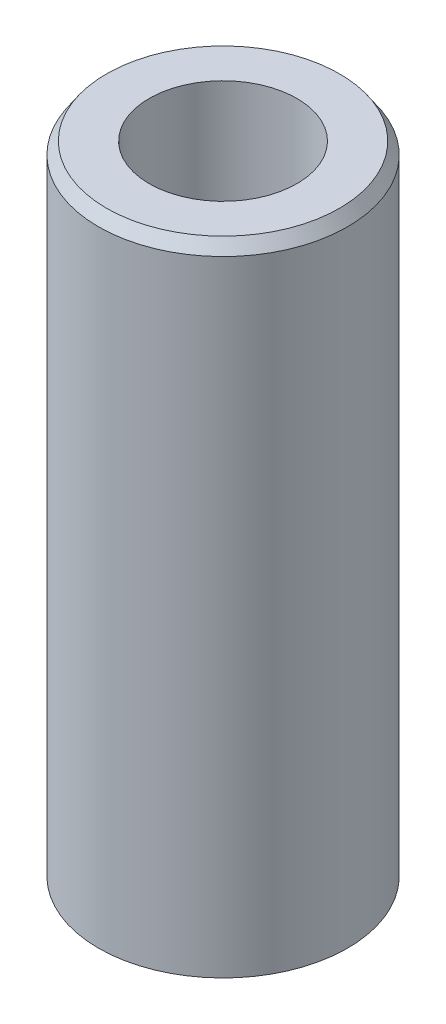
ISO-10303-21;
HEADER;
FILE_DESCRIPTION(('STEP AP214'),'2;1');
FILE_NAME('part.step','',(''),(''),'','','');
FILE_SCHEMA(('AUTOMOTIVE_DESIGN { 1 0 10303 214 1 1 1 1 }'));
ENDSEC;
DATA;
#1=APPLICATION_CONTEXT('core data for automotive mechanical design processes');
#2=APPLICATION_PROTOCOL_DEFINITION('international standard','automotive_design',2000,#1);
#3=PRODUCT_CONTEXT('',#1,'mechanical');
#4=PRODUCT('Part','Part','',(#3));
#5=PRODUCT_RELATED_PRODUCT_CATEGORY('part','',(#4));
#6=PRODUCT_DEFINITION_FORMATION('','',#4);
#7=PRODUCT_DEFINITION_CONTEXT('part definition',#1,'design');
#8=PRODUCT_DEFINITION('design','',#6,#7);
#9=PRODUCT_DEFINITION_SHAPE('','',#8);
#10=(LENGTH_UNIT() NAMED_UNIT(*) SI_UNIT(.MILLI.,.METRE.));
#11=(NAMED_UNIT(*) PLANE_ANGLE_UNIT() SI_UNIT($,.RADIAN.));
#12=(NAMED_UNIT(*) SI_UNIT($,.STERADIAN.) SOLID_ANGLE_UNIT());
#13=UNCERTAINTY_MEASURE_WITH_UNIT(LENGTH_MEASURE(1.E-05),#10,'distance_accuracy_value','');
#14=(GEOMETRIC_REPRESENTATION_CONTEXT(3) GLOBAL_UNCERTAINTY_ASSIGNED_CONTEXT((#13)) GLOBAL_UNIT_ASSIGNED_CONTEXT((#10,
#11,#12)) REPRESENTATION_CONTEXT('',''));
#15=CARTESIAN_POINT('',(0.,0.,0.));
#16=DIRECTION('',(0.,0.,1.));
#17=DIRECTION('',(1.,0.,0.));
#18=AXIS2_PLACEMENT_3D('',#15,#16,#17);
#19=CARTESIAN_POINT('',(0.,168.236509866278,0.));
#20=DIRECTION('',(0.,-1.,0.));
#21=DIRECTION('',(0.,0.,-1.));
#22=AXIS2_PLACEMENT_3D('',#19,#20,#21);
#23=CYLINDRICAL_SURFACE('',#22,32.5);
#24=CARTESIAN_POINT('',(0.,165.111827797363,0.));
#25=DIRECTION('',(0.,1.,0.));
#26=DIRECTION('',(0.,0.,1.));
#27=AXIS2_PLACEMENT_3D('',#24,#25,#26);
#28=CIRCLE('',#27,32.5);
#29=CARTESIAN_POINT('',(0.,165.111827797363,32.5));
#30=VERTEX_POINT('',#29);
#31=EDGE_CURVE('E50',#30,#30,#28,.F.);
#32=ORIENTED_EDGE('',*,*,#31,.T.);
#33=EDGE_LOOP('',(#32));
#34=FACE_BOUND('',#33,.T.);
#35=CARTESIAN_POINT('',(0.,2.10651666954706,0.));
#36=DIRECTION('',(0.,1.,0.));
#37=DIRECTION('',(0.,0.,1.));
#38=AXIS2_PLACEMENT_3D('',#35,#36,#37);
#39=CIRCLE('',#38,32.5);
#40=CARTESIAN_POINT('',(0.,2.10651666954706,32.5));
#41=VERTEX_POINT('',#40);
#42=EDGE_CURVE('E51',#41,#41,#39,.T.);
#43=ORIENTED_EDGE('',*,*,#42,.T.);
#44=EDGE_LOOP('',(#43));
#45=FACE_BOUND('',#44,.T.);
#46=ADVANCED_FACE('F39',(#34,#45),#23,.T.);
#47=CARTESIAN_POINT('',(0.,168.236509866278,0.));
#48=DIRECTION('',(0.,1.,0.));
#49=DIRECTION('',(0.,0.,1.));
#50=AXIS2_PLACEMENT_3D('',#47,#48,#49);
#51=PLANE('',#50);
#52=CARTESIAN_POINT('',(0.,168.236509866278,0.));
#53=DIRECTION('',(0.,1.,0.));
#54=DIRECTION('',(0.,0.,1.));
#55=AXIS2_PLACEMENT_3D('',#52,#53,#54);
#56=CIRCLE('',#55,30.3934833304529);
#57=CARTESIAN_POINT('',(0.,168.236509866278,30.3934833304529));
#58=VERTEX_POINT('',#57);
#59=EDGE_CURVE('E54',#58,#58,#56,.T.);
#60=ORIENTED_EDGE('',*,*,#59,.T.);
#61=EDGE_LOOP('',(#60));
#62=FACE_BOUND('',#61,.T.);
#63=CARTESIAN_POINT('',(0.,168.236509866278,0.));
#64=DIRECTION('',(0.,1.,0.));
#65=DIRECTION('',(0.,0.,1.));
#66=AXIS2_PLACEMENT_3D('',#63,#64,#65);
#67=CIRCLE('',#66,19.2739795571671);
#68=CARTESIAN_POINT('',(0.,168.236509866278,19.2739795571671));
#69=VERTEX_POINT('',#68);
#70=EDGE_CURVE('E58',#69,#69,#67,.T.);
#71=ORIENTED_EDGE('',*,*,#70,.F.);
#72=EDGE_LOOP('',(#71));
#73=FACE_BOUND('',#72,.T.);
#74=ADVANCED_FACE('F69',(#62,#73),#51,.T.);
#75=CARTESIAN_POINT('',(0.,0.,0.));
#76=DIRECTION('',(0.,1.,0.));
#77=DIRECTION('',(0.,0.,1.));
#78=AXIS2_PLACEMENT_3D('',#75,#76,#77);
#79=PLANE('',#78);
#80=CARTESIAN_POINT('',(0.,0.,0.));
#81=DIRECTION('',(0.,1.,0.));
#82=DIRECTION('',(0.,0.,1.));
#83=AXIS2_PLACEMENT_3D('',#80,#81,#82);
#84=CIRCLE('',#83,29.3753179310854);
#85=CARTESIAN_POINT('',(0.,0.,29.3753179310854));
#86=VERTEX_POINT('',#85);
#87=EDGE_CURVE('E10',#86,#86,#84,.F.);
#88=ORIENTED_EDGE('',*,*,#87,.T.);
#89=EDGE_LOOP('',(#88));
#90=FACE_BOUND('',#89,.T.);
#91=CARTESIAN_POINT('',(0.,0.,0.));
#92=DIRECTION('',(0.,1.,0.));
#93=DIRECTION('',(0.,0.,1.));
#94=AXIS2_PLACEMENT_3D('',#91,#92,#93);
#95=CIRCLE('',#94,19.2739795571671);
#96=CARTESIAN_POINT('',(0.,0.,19.2739795571671));
#97=VERTEX_POINT('',#96);
#98=EDGE_CURVE('E63',#97,#97,#95,.T.);
#99=ORIENTED_EDGE('',*,*,#98,.T.);
#100=EDGE_LOOP('',(#99));
#101=FACE_BOUND('',#100,.T.);
#102=ADVANCED_FACE('F75',(#90,#101),#79,.F.);
#103=CARTESIAN_POINT('',(0.,168.236509866278,0.));
#104=DIRECTION('',(0.,-1.,0.));
#105=DIRECTION('',(0.,0.,-1.));
#106=AXIS2_PLACEMENT_3D('',#103,#104,#105);
#107=CYLINDRICAL_SURFACE('',#106,19.2739795571671);
#108=ORIENTED_EDGE('',*,*,#70,.T.);
#109=EDGE_LOOP('',(#108));
#110=FACE_BOUND('',#109,.T.);
#111=ORIENTED_EDGE('',*,*,#98,.F.);
#112=EDGE_LOOP('',(#111));
#113=FACE_BOUND('',#112,.T.);
#114=ADVANCED_FACE('F70',(#110,#113),#107,.F.);
#115=CARTESIAN_POINT('',(0.,168.236509866278,0.));
#116=DIRECTION('',(0.,-1.,0.));
#117=DIRECTION('',(0.,0.,-1.));
#118=AXIS2_PLACEMENT_3D('',#115,#116,#117);
#119=CONICAL_SURFACE('',#118,30.3934833304529,0.593168190921273);
#120=ORIENTED_EDGE('',*,*,#31,.F.);
#121=EDGE_LOOP('',(#120));
#122=FACE_BOUND('',#121,.T.);
#123=ORIENTED_EDGE('',*,*,#59,.F.);
#124=EDGE_LOOP('',(#123));
#125=FACE_BOUND('',#124,.T.);
#126=ADVANCED_FACE('F81',(#122,#125),#119,.T.);
#127=CARTESIAN_POINT('',(0.,2.10651666954706,0.));
#128=DIRECTION('',(0.,1.,0.));
#129=DIRECTION('',(0.,0.,1.));
#130=AXIS2_PLACEMENT_3D('',#127,#128,#129);
#131=CONICAL_SURFACE('',#130,32.5,0.977628135873628);
#132=ORIENTED_EDGE('',*,*,#87,.F.);
#133=EDGE_LOOP('',(#132));
#134=FACE_BOUND('',#133,.T.);
#135=ORIENTED_EDGE('',*,*,#42,.F.);
#136=EDGE_LOOP('',(#135));
#137=FACE_BOUND('',#136,.T.);
#138=ADVANCED_FACE('F45',(#134,#137),#131,.T.);
#139=CLOSED_SHELL('',(#46,#74,#102,#114,#126,#138));
#140=MANIFOLD_SOLID_BREP('B2',#139);
#141=ADVANCED_BREP_SHAPE_REPRESENTATION('',(#18,#140),#14);
#142=SHAPE_DEFINITION_REPRESENTATION(#9,#141);
ENDSEC;
END-ISO-10303-21;
